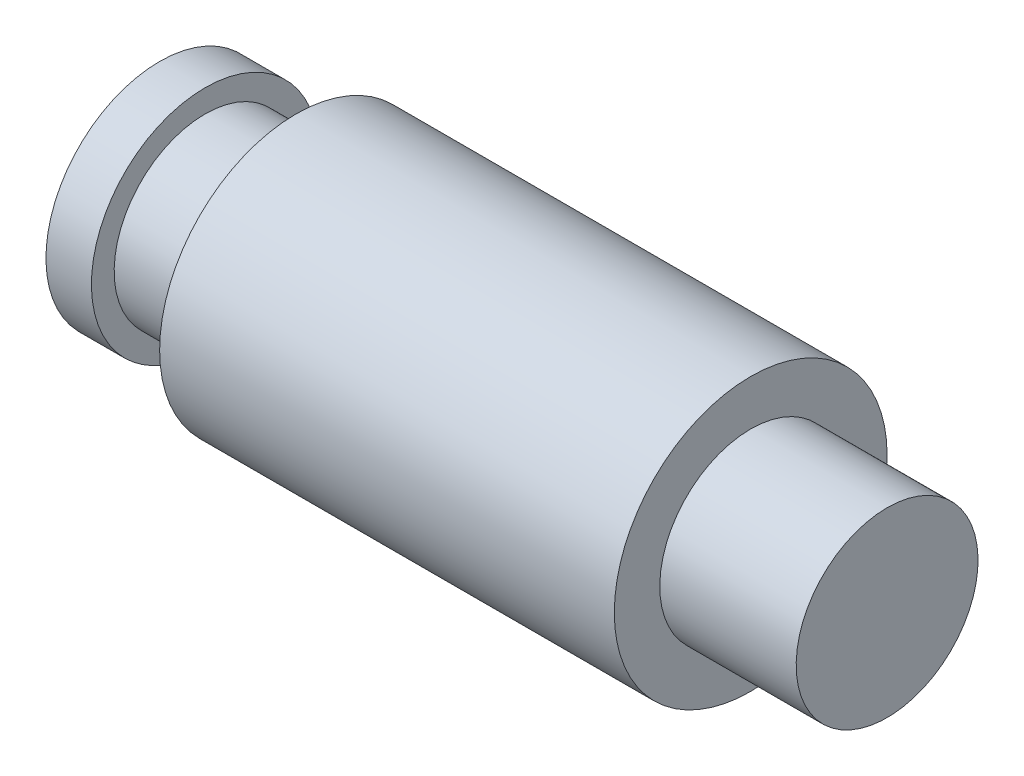
ISO-10303-21;
HEADER;
FILE_DESCRIPTION(('STEP AP214'),'2;1');
FILE_NAME('part.step','',(''),(''),'','','');
FILE_SCHEMA(('AUTOMOTIVE_DESIGN { 1 0 10303 214 1 1 1 1 }'));
ENDSEC;
DATA;
#1=APPLICATION_CONTEXT('core data for automotive mechanical design processes');
#2=APPLICATION_PROTOCOL_DEFINITION('international standard','automotive_design',2000,#1);
#3=PRODUCT_CONTEXT('',#1,'mechanical');
#4=PRODUCT('Part','Part','',(#3));
#5=PRODUCT_RELATED_PRODUCT_CATEGORY('part','',(#4));
#6=PRODUCT_DEFINITION_FORMATION('','',#4);
#7=PRODUCT_DEFINITION_CONTEXT('part definition',#1,'design');
#8=PRODUCT_DEFINITION('design','',#6,#7);
#9=PRODUCT_DEFINITION_SHAPE('','',#8);
#10=(LENGTH_UNIT() NAMED_UNIT(*) SI_UNIT(.MILLI.,.METRE.));
#11=(NAMED_UNIT(*) PLANE_ANGLE_UNIT() SI_UNIT($,.RADIAN.));
#12=(NAMED_UNIT(*) SI_UNIT($,.STERADIAN.) SOLID_ANGLE_UNIT());
#13=UNCERTAINTY_MEASURE_WITH_UNIT(LENGTH_MEASURE(1.E-05),#10,'distance_accuracy_value','');
#14=(GEOMETRIC_REPRESENTATION_CONTEXT(3) GLOBAL_UNCERTAINTY_ASSIGNED_CONTEXT((#13)) GLOBAL_UNIT_ASSIGNED_CONTEXT((#10,
#11,#12)) REPRESENTATION_CONTEXT('',''));
#15=CARTESIAN_POINT('',(0.,0.,0.));
#16=DIRECTION('',(0.,0.,1.));
#17=DIRECTION('',(1.,0.,0.));
#18=AXIS2_PLACEMENT_3D('',#15,#16,#17);
#19=CARTESIAN_POINT('',(0.,0.,0.));
#20=DIRECTION('',(-1.,0.,0.));
#21=DIRECTION('',(0.,-1.,0.));
#22=AXIS2_PLACEMENT_3D('',#19,#20,#21);
#23=PLANE('',#22);
#24=CARTESIAN_POINT('',(0.,0.,0.));
#25=DIRECTION('',(1.,0.,0.));
#26=DIRECTION('',(0.,1.,0.));
#27=AXIS2_PLACEMENT_3D('',#24,#25,#26);
#28=CIRCLE('',#27,2.5);
#29=CARTESIAN_POINT('',(0.,2.5,0.));
#30=VERTEX_POINT('',#29);
#31=EDGE_CURVE('E10',#30,#30,#28,.T.);
#32=ORIENTED_EDGE('',*,*,#31,.F.);
#33=EDGE_LOOP('',(#32));
#34=FACE_BOUND('',#33,.T.);
#35=ADVANCED_FACE('F32',(#34),#23,.T.);
#36=CARTESIAN_POINT('',(16.,0.,0.));
#37=DIRECTION('',(1.,0.,0.));
#38=DIRECTION('',(0.,1.,0.));
#39=AXIS2_PLACEMENT_3D('',#36,#37,#38);
#40=CYLINDRICAL_SURFACE('',#39,2.5);
#41=ORIENTED_EDGE('',*,*,#31,.T.);
#42=EDGE_LOOP('',(#41));
#43=FACE_BOUND('',#42,.T.);
#44=CARTESIAN_POINT('',(1.,0.,0.));
#45=DIRECTION('',(1.,0.,0.));
#46=DIRECTION('',(0.,1.,0.));
#47=AXIS2_PLACEMENT_3D('',#44,#45,#46);
#48=CIRCLE('',#47,2.5);
#49=CARTESIAN_POINT('',(1.,2.5,0.));
#50=VERTEX_POINT('',#49);
#51=EDGE_CURVE('E38',#50,#50,#48,.T.);
#52=ORIENTED_EDGE('',*,*,#51,.F.);
#53=EDGE_LOOP('',(#52));
#54=FACE_BOUND('',#53,.T.);
#55=ADVANCED_FACE('F80',(#43,#54),#40,.T.);
#56=CARTESIAN_POINT('',(1.,2.5,0.));
#57=DIRECTION('',(1.,0.,0.));
#58=DIRECTION('',(0.,1.,0.));
#59=AXIS2_PLACEMENT_3D('',#56,#57,#58);
#60=PLANE('',#59);
#61=ORIENTED_EDGE('',*,*,#51,.T.);
#62=EDGE_LOOP('',(#61));
#63=FACE_BOUND('',#62,.T.);
#64=CARTESIAN_POINT('',(1.,0.,0.));
#65=DIRECTION('',(1.,0.,0.));
#66=DIRECTION('',(0.,1.,0.));
#67=AXIS2_PLACEMENT_3D('',#64,#65,#66);
#68=CIRCLE('',#67,2.);
#69=CARTESIAN_POINT('',(1.,2.,0.));
#70=VERTEX_POINT('',#69);
#71=EDGE_CURVE('E42',#70,#70,#68,.T.);
#72=ORIENTED_EDGE('',*,*,#71,.F.);
#73=EDGE_LOOP('',(#72));
#74=FACE_BOUND('',#73,.T.);
#75=ADVANCED_FACE('F85',(#63,#74),#60,.T.);
#76=CARTESIAN_POINT('',(16.,0.,0.));
#77=DIRECTION('',(1.,0.,0.));
#78=DIRECTION('',(0.,1.,0.));
#79=AXIS2_PLACEMENT_3D('',#76,#77,#78);
#80=CYLINDRICAL_SURFACE('',#79,2.);
#81=ORIENTED_EDGE('',*,*,#71,.T.);
#82=EDGE_LOOP('',(#81));
#83=FACE_BOUND('',#82,.T.);
#84=CARTESIAN_POINT('',(3.,0.,0.));
#85=DIRECTION('',(1.,0.,0.));
#86=DIRECTION('',(0.,1.,0.));
#87=AXIS2_PLACEMENT_3D('',#84,#85,#86);
#88=CIRCLE('',#87,2.);
#89=CARTESIAN_POINT('',(3.,2.,0.));
#90=VERTEX_POINT('',#89);
#91=EDGE_CURVE('E46',#90,#90,#88,.T.);
#92=ORIENTED_EDGE('',*,*,#91,.F.);
#93=EDGE_LOOP('',(#92));
#94=FACE_BOUND('',#93,.T.);
#95=ADVANCED_FACE('F89',(#83,#94),#80,.T.);
#96=CARTESIAN_POINT('',(3.,2.,0.));
#97=DIRECTION('',(-1.,0.,0.));
#98=DIRECTION('',(0.,-1.,0.));
#99=AXIS2_PLACEMENT_3D('',#96,#97,#98);
#100=PLANE('',#99);
#101=ORIENTED_EDGE('',*,*,#91,.T.);
#102=EDGE_LOOP('',(#101));
#103=FACE_BOUND('',#102,.T.);
#104=CARTESIAN_POINT('',(3.,0.,0.));
#105=DIRECTION('',(1.,0.,0.));
#106=DIRECTION('',(0.,1.,0.));
#107=AXIS2_PLACEMENT_3D('',#104,#105,#106);
#108=CIRCLE('',#107,3.);
#109=CARTESIAN_POINT('',(3.,3.,0.));
#110=VERTEX_POINT('',#109);
#111=EDGE_CURVE('E51',#110,#110,#108,.T.);
#112=ORIENTED_EDGE('',*,*,#111,.F.);
#113=EDGE_LOOP('',(#112));
#114=FACE_BOUND('',#113,.T.);
#115=ADVANCED_FACE('F95',(#103,#114),#100,.T.);
#116=CARTESIAN_POINT('',(16.,0.,0.));
#117=DIRECTION('',(1.,0.,0.));
#118=DIRECTION('',(0.,1.,0.));
#119=AXIS2_PLACEMENT_3D('',#116,#117,#118);
#120=CYLINDRICAL_SURFACE('',#119,3.);
#121=ORIENTED_EDGE('',*,*,#111,.T.);
#122=EDGE_LOOP('',(#121));
#123=FACE_BOUND('',#122,.T.);
#124=CARTESIAN_POINT('',(13.,0.,0.));
#125=DIRECTION('',(1.,0.,0.));
#126=DIRECTION('',(0.,1.,0.));
#127=AXIS2_PLACEMENT_3D('',#124,#125,#126);
#128=CIRCLE('',#127,3.);
#129=CARTESIAN_POINT('',(13.,3.,0.));
#130=VERTEX_POINT('',#129);
#131=EDGE_CURVE('E54',#130,#130,#128,.T.);
#132=ORIENTED_EDGE('',*,*,#131,.F.);
#133=EDGE_LOOP('',(#132));
#134=FACE_BOUND('',#133,.T.);
#135=ADVANCED_FACE('F76',(#123,#134),#120,.T.);
#136=CARTESIAN_POINT('',(13.,3.,0.));
#137=DIRECTION('',(1.,0.,0.));
#138=DIRECTION('',(0.,1.,0.));
#139=AXIS2_PLACEMENT_3D('',#136,#137,#138);
#140=PLANE('',#139);
#141=ORIENTED_EDGE('',*,*,#131,.T.);
#142=EDGE_LOOP('',(#141));
#143=FACE_BOUND('',#142,.T.);
#144=CARTESIAN_POINT('',(13.,0.,0.));
#145=DIRECTION('',(1.,0.,0.));
#146=DIRECTION('',(0.,1.,0.));
#147=AXIS2_PLACEMENT_3D('',#144,#145,#146);
#148=CIRCLE('',#147,2.);
#149=CARTESIAN_POINT('',(13.,2.,0.));
#150=VERTEX_POINT('',#149);
#151=EDGE_CURVE('E57',#150,#150,#148,.T.);
#152=ORIENTED_EDGE('',*,*,#151,.F.);
#153=EDGE_LOOP('',(#152));
#154=FACE_BOUND('',#153,.T.);
#155=ADVANCED_FACE('F68',(#143,#154),#140,.T.);
#156=CARTESIAN_POINT('',(16.,0.,0.));
#157=DIRECTION('',(1.,0.,0.));
#158=DIRECTION('',(0.,1.,0.));
#159=AXIS2_PLACEMENT_3D('',#156,#157,#158);
#160=CYLINDRICAL_SURFACE('',#159,2.);
#161=ORIENTED_EDGE('',*,*,#151,.T.);
#162=EDGE_LOOP('',(#161));
#163=FACE_BOUND('',#162,.T.);
#164=CARTESIAN_POINT('',(16.,0.,0.));
#165=DIRECTION('',(1.,0.,0.));
#166=DIRECTION('',(0.,1.,0.));
#167=AXIS2_PLACEMENT_3D('',#164,#165,#166);
#168=CIRCLE('',#167,2.);
#169=CARTESIAN_POINT('',(16.,2.,0.));
#170=VERTEX_POINT('',#169);
#171=EDGE_CURVE('E60',#170,#170,#168,.T.);
#172=ORIENTED_EDGE('',*,*,#171,.F.);
#173=EDGE_LOOP('',(#172));
#174=FACE_BOUND('',#173,.T.);
#175=ADVANCED_FACE('F66',(#163,#174),#160,.T.);
#176=CARTESIAN_POINT('',(16.,2.,0.));
#177=DIRECTION('',(1.,0.,0.));
#178=DIRECTION('',(0.,1.,0.));
#179=AXIS2_PLACEMENT_3D('',#176,#177,#178);
#180=PLANE('',#179);
#181=ORIENTED_EDGE('',*,*,#171,.T.);
#182=EDGE_LOOP('',(#181));
#183=FACE_BOUND('',#182,.T.);
#184=ADVANCED_FACE('F64',(#183),#180,.T.);
#185=CLOSED_SHELL('',(#35,#55,#75,#95,#115,#135,#155,#175,#184));
#186=MANIFOLD_SOLID_BREP('B2',#185);
#187=ADVANCED_BREP_SHAPE_REPRESENTATION('',(#18,#186),#14);
#188=SHAPE_DEFINITION_REPRESENTATION(#9,#187);
ENDSEC;
END-ISO-10303-21;
